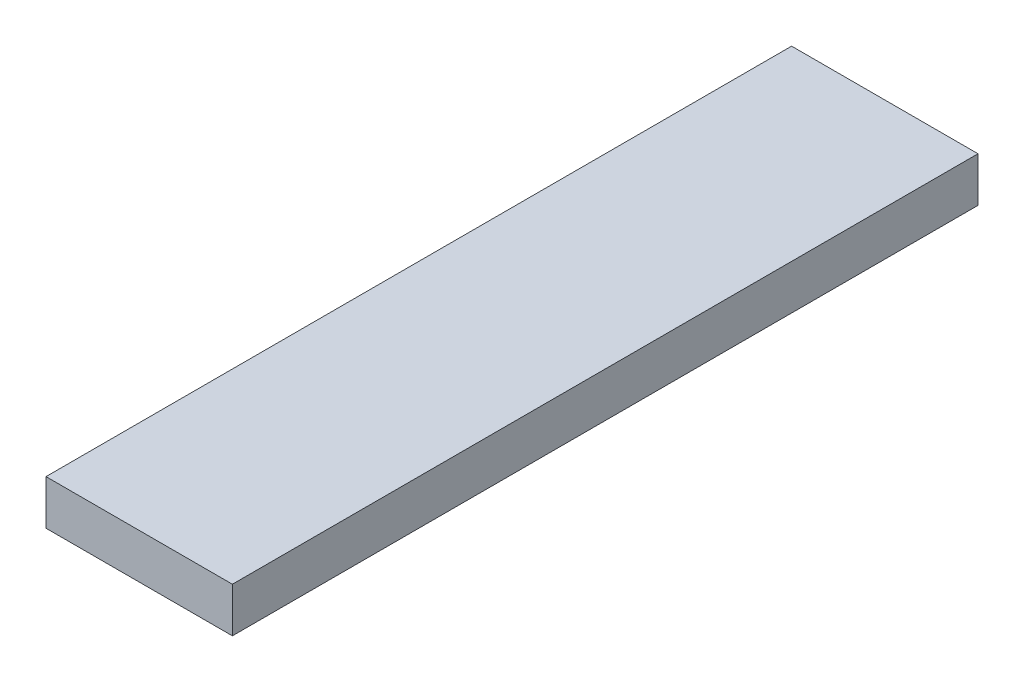
ISO-10303-21;
HEADER;
FILE_DESCRIPTION(('STEP AP214'),'2;1');
FILE_NAME('part.step','',(''),(''),'','','');
FILE_SCHEMA(('AUTOMOTIVE_DESIGN { 1 0 10303 214 1 1 1 1 }'));
ENDSEC;
DATA;
#1=APPLICATION_CONTEXT('core data for automotive mechanical design processes');
#2=APPLICATION_PROTOCOL_DEFINITION('international standard','automotive_design',2000,#1);
#3=PRODUCT_CONTEXT('',#1,'mechanical');
#4=PRODUCT('Part','Part','',(#3));
#5=PRODUCT_RELATED_PRODUCT_CATEGORY('part','',(#4));
#6=PRODUCT_DEFINITION_FORMATION('','',#4);
#7=PRODUCT_DEFINITION_CONTEXT('part definition',#1,'design');
#8=PRODUCT_DEFINITION('design','',#6,#7);
#9=PRODUCT_DEFINITION_SHAPE('','',#8);
#10=(LENGTH_UNIT() NAMED_UNIT(*) SI_UNIT(.MILLI.,.METRE.));
#11=(NAMED_UNIT(*) PLANE_ANGLE_UNIT() SI_UNIT($,.RADIAN.));
#12=(NAMED_UNIT(*) SI_UNIT($,.STERADIAN.) SOLID_ANGLE_UNIT());
#13=UNCERTAINTY_MEASURE_WITH_UNIT(LENGTH_MEASURE(1.E-05),#10,'distance_accuracy_value','');
#14=(GEOMETRIC_REPRESENTATION_CONTEXT(3) GLOBAL_UNCERTAINTY_ASSIGNED_CONTEXT((#13)) GLOBAL_UNIT_ASSIGNED_CONTEXT((#10,
#11,#12)) REPRESENTATION_CONTEXT('',''));
#15=CARTESIAN_POINT('',(0.,0.,0.));
#16=DIRECTION('',(0.,0.,1.));
#17=DIRECTION('',(1.,0.,0.));
#18=AXIS2_PLACEMENT_3D('',#15,#16,#17);
#19=CARTESIAN_POINT('',(10.,0.,0.));
#20=DIRECTION('',(0.,0.,-1.));
#21=DIRECTION('',(-1.,0.,0.));
#22=AXIS2_PLACEMENT_3D('',#19,#20,#21);
#23=PLANE('',#22);
#24=DIRECTION('',(0.,-1.,0.));
#25=VECTOR('',#24,1.);
#26=CARTESIAN_POINT('',(0.,0.,0.));
#27=LINE('',#26,#25);
#28=CARTESIAN_POINT('',(0.,2.4,0.));
#29=VERTEX_POINT('',#28);
#30=CARTESIAN_POINT('',(0.,0.,0.));
#31=VERTEX_POINT('',#30);
#32=EDGE_CURVE('E95',#29,#31,#27,.T.);
#33=ORIENTED_EDGE('',*,*,#32,.T.);
#34=DIRECTION('',(-1.,0.,0.));
#35=VECTOR('',#34,1.);
#36=CARTESIAN_POINT('',(10.,0.,0.));
#37=LINE('',#36,#35);
#38=CARTESIAN_POINT('',(10.,0.,0.));
#39=VERTEX_POINT('',#38);
#40=EDGE_CURVE('E11',#39,#31,#37,.T.);
#41=ORIENTED_EDGE('',*,*,#40,.F.);
#42=DIRECTION('',(0.,-1.,0.));
#43=VECTOR('',#42,1.);
#44=CARTESIAN_POINT('',(10.,0.,0.));
#45=LINE('',#44,#43);
#46=CARTESIAN_POINT('',(10.,2.4,0.));
#47=VERTEX_POINT('',#46);
#48=EDGE_CURVE('E83',#47,#39,#45,.T.);
#49=ORIENTED_EDGE('',*,*,#48,.F.);
#50=DIRECTION('',(-1.,0.,0.));
#51=VECTOR('',#50,1.);
#52=CARTESIAN_POINT('',(10.,2.4,0.));
#53=LINE('',#52,#51);
#54=EDGE_CURVE('E91',#47,#29,#53,.T.);
#55=ORIENTED_EDGE('',*,*,#54,.T.);
#56=EDGE_LOOP('',(#33,#41,#49,#55));
#57=FACE_BOUND('',#56,.T.);
#58=ADVANCED_FACE('F32',(#57),#23,.F.);
#59=CARTESIAN_POINT('',(10.,0.,0.));
#60=DIRECTION('',(0.,1.,0.));
#61=DIRECTION('',(0.,0.,1.));
#62=AXIS2_PLACEMENT_3D('',#59,#60,#61);
#63=PLANE('',#62);
#64=DIRECTION('',(0.,0.,-1.));
#65=VECTOR('',#64,1.);
#66=CARTESIAN_POINT('',(0.,0.,0.));
#67=LINE('',#66,#65);
#68=CARTESIAN_POINT('',(0.,0.,-40.));
#69=VERTEX_POINT('',#68);
#70=EDGE_CURVE('E87',#31,#69,#67,.T.);
#71=ORIENTED_EDGE('',*,*,#70,.T.);
#72=DIRECTION('',(-1.,0.,0.));
#73=VECTOR('',#72,1.);
#74=CARTESIAN_POINT('',(10.,0.,-40.));
#75=LINE('',#74,#73);
#76=CARTESIAN_POINT('',(10.,0.,-40.));
#77=VERTEX_POINT('',#76);
#78=EDGE_CURVE('E40',#77,#69,#75,.T.);
#79=ORIENTED_EDGE('',*,*,#78,.F.);
#80=DIRECTION('',(0.,0.,-1.));
#81=VECTOR('',#80,1.);
#82=CARTESIAN_POINT('',(10.,0.,0.));
#83=LINE('',#82,#81);
#84=EDGE_CURVE('E78',#39,#77,#83,.T.);
#85=ORIENTED_EDGE('',*,*,#84,.F.);
#86=ORIENTED_EDGE('',*,*,#40,.T.);
#87=EDGE_LOOP('',(#71,#79,#85,#86));
#88=FACE_BOUND('',#87,.T.);
#89=ADVANCED_FACE('F86',(#88),#63,.F.);
#90=CARTESIAN_POINT('',(10.,0.,-40.));
#91=DIRECTION('',(0.,0.,1.));
#92=DIRECTION('',(1.,0.,0.));
#93=AXIS2_PLACEMENT_3D('',#90,#91,#92);
#94=PLANE('',#93);
#95=DIRECTION('',(0.,1.,0.));
#96=VECTOR('',#95,1.);
#97=CARTESIAN_POINT('',(0.,0.,-40.));
#98=LINE('',#97,#96);
#99=CARTESIAN_POINT('',(0.,2.4,-40.));
#100=VERTEX_POINT('',#99);
#101=EDGE_CURVE('E65',#69,#100,#98,.T.);
#102=ORIENTED_EDGE('',*,*,#101,.T.);
#103=DIRECTION('',(-1.,0.,0.));
#104=VECTOR('',#103,1.);
#105=CARTESIAN_POINT('',(10.,2.4,-40.));
#106=LINE('',#105,#104);
#107=CARTESIAN_POINT('',(10.,2.4,-40.));
#108=VERTEX_POINT('',#107);
#109=EDGE_CURVE('E88',#108,#100,#106,.T.);
#110=ORIENTED_EDGE('',*,*,#109,.F.);
#111=DIRECTION('',(0.,1.,0.));
#112=VECTOR('',#111,1.);
#113=CARTESIAN_POINT('',(10.,0.,-40.));
#114=LINE('',#113,#112);
#115=EDGE_CURVE('E81',#77,#108,#114,.T.);
#116=ORIENTED_EDGE('',*,*,#115,.F.);
#117=ORIENTED_EDGE('',*,*,#78,.T.);
#118=EDGE_LOOP('',(#102,#110,#116,#117));
#119=FACE_BOUND('',#118,.T.);
#120=ADVANCED_FACE('F89',(#119),#94,.F.);
#121=CARTESIAN_POINT('',(10.,2.4,0.));
#122=DIRECTION('',(0.,-1.,0.));
#123=DIRECTION('',(0.,0.,-1.));
#124=AXIS2_PLACEMENT_3D('',#121,#122,#123);
#125=PLANE('',#124);
#126=DIRECTION('',(0.,0.,1.));
#127=VECTOR('',#126,1.);
#128=CARTESIAN_POINT('',(0.,2.4,0.));
#129=LINE('',#128,#127);
#130=EDGE_CURVE('E71',#100,#29,#129,.T.);
#131=ORIENTED_EDGE('',*,*,#130,.T.);
#132=ORIENTED_EDGE('',*,*,#54,.F.);
#133=DIRECTION('',(0.,0.,1.));
#134=VECTOR('',#133,1.);
#135=CARTESIAN_POINT('',(10.,2.4,0.));
#136=LINE('',#135,#134);
#137=EDGE_CURVE('E48',#108,#47,#136,.T.);
#138=ORIENTED_EDGE('',*,*,#137,.F.);
#139=ORIENTED_EDGE('',*,*,#109,.T.);
#140=EDGE_LOOP('',(#131,#132,#138,#139));
#141=FACE_BOUND('',#140,.T.);
#142=ADVANCED_FACE('F102',(#141),#125,.F.);
#143=CARTESIAN_POINT('',(10.,0.,0.));
#144=DIRECTION('',(-1.,0.,0.));
#145=DIRECTION('',(0.,0.,1.));
#146=AXIS2_PLACEMENT_3D('',#143,#144,#145);
#147=PLANE('',#146);
#148=ORIENTED_EDGE('',*,*,#48,.T.);
#149=ORIENTED_EDGE('',*,*,#84,.T.);
#150=ORIENTED_EDGE('',*,*,#115,.T.);
#151=ORIENTED_EDGE('',*,*,#137,.T.);
#152=EDGE_LOOP('',(#148,#149,#150,#151));
#153=FACE_BOUND('',#152,.T.);
#154=ADVANCED_FACE('F79',(#153),#147,.F.);
#155=CARTESIAN_POINT('',(0.,0.,0.));
#156=DIRECTION('',(-1.,0.,0.));
#157=DIRECTION('',(0.,0.,1.));
#158=AXIS2_PLACEMENT_3D('',#155,#156,#157);
#159=PLANE('',#158);
#160=ORIENTED_EDGE('',*,*,#32,.F.);
#161=ORIENTED_EDGE('',*,*,#130,.F.);
#162=ORIENTED_EDGE('',*,*,#101,.F.);
#163=ORIENTED_EDGE('',*,*,#70,.F.);
#164=EDGE_LOOP('',(#160,#161,#162,#163));
#165=FACE_BOUND('',#164,.T.);
#166=ADVANCED_FACE('F105',(#165),#159,.T.);
#167=CLOSED_SHELL('',(#58,#89,#120,#142,#154,#166));
#168=MANIFOLD_SOLID_BREP('B2',#167);
#169=ADVANCED_BREP_SHAPE_REPRESENTATION('',(#18,#168),#14);
#170=SHAPE_DEFINITION_REPRESENTATION(#9,#169);
ENDSEC;
END-ISO-10303-21;
